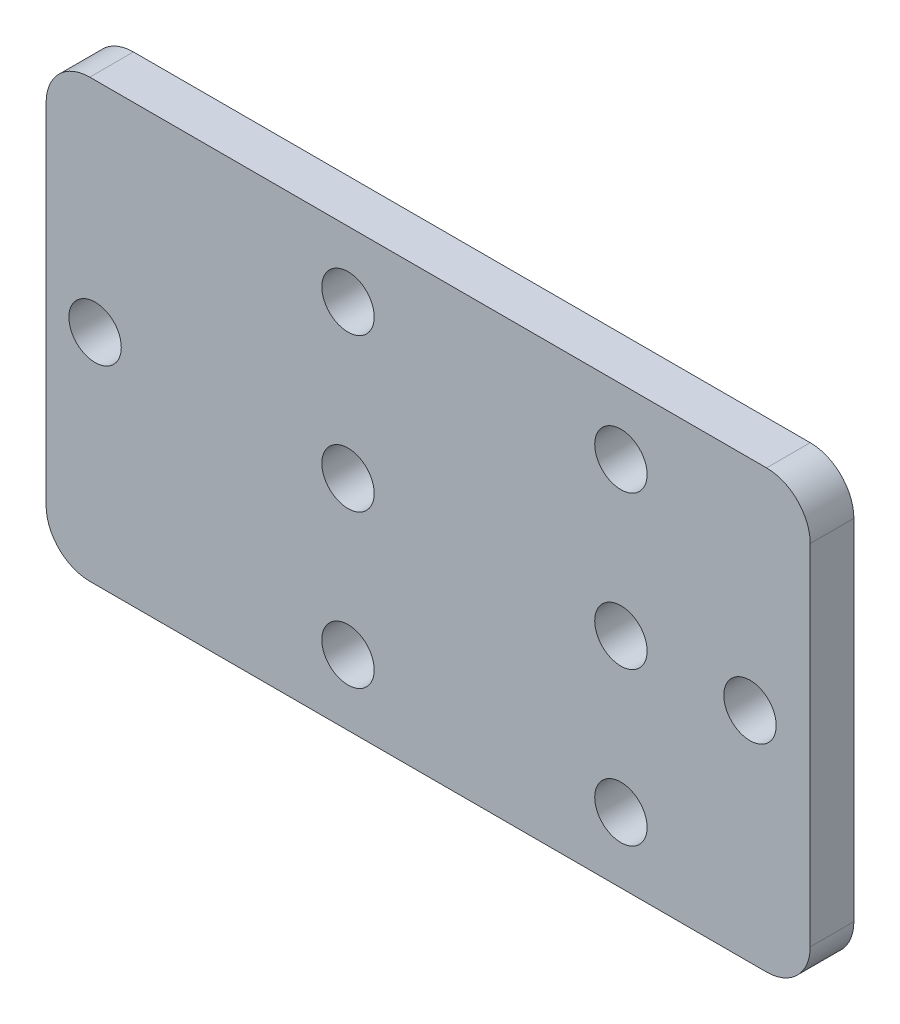
ISO-10303-21;
HEADER;
FILE_DESCRIPTION(('STEP AP214'),'2;1');
FILE_NAME('part.step','',(''),(''),'','','');
FILE_SCHEMA(('AUTOMOTIVE_DESIGN { 1 0 10303 214 1 1 1 1 }'));
ENDSEC;
DATA;
#1=APPLICATION_CONTEXT('core data for automotive mechanical design processes');
#2=APPLICATION_PROTOCOL_DEFINITION('international standard','automotive_design',2000,#1);
#3=PRODUCT_CONTEXT('',#1,'mechanical');
#4=PRODUCT('Part','Part','',(#3));
#5=PRODUCT_RELATED_PRODUCT_CATEGORY('part','',(#4));
#6=PRODUCT_DEFINITION_FORMATION('','',#4);
#7=PRODUCT_DEFINITION_CONTEXT('part definition',#1,'design');
#8=PRODUCT_DEFINITION('design','',#6,#7);
#9=PRODUCT_DEFINITION_SHAPE('','',#8);
#10=(LENGTH_UNIT() NAMED_UNIT(*) SI_UNIT(.MILLI.,.METRE.));
#11=(NAMED_UNIT(*) PLANE_ANGLE_UNIT() SI_UNIT($,.RADIAN.));
#12=(NAMED_UNIT(*) SI_UNIT($,.STERADIAN.) SOLID_ANGLE_UNIT());
#13=UNCERTAINTY_MEASURE_WITH_UNIT(LENGTH_MEASURE(1.E-05),#10,'distance_accuracy_value','');
#14=(GEOMETRIC_REPRESENTATION_CONTEXT(3) GLOBAL_UNCERTAINTY_ASSIGNED_CONTEXT((#13)) GLOBAL_UNIT_ASSIGNED_CONTEXT((#10,
#11,#12)) REPRESENTATION_CONTEXT('',''));
#15=CARTESIAN_POINT('',(0.,0.,0.));
#16=DIRECTION('',(0.,0.,1.));
#17=DIRECTION('',(1.,0.,0.));
#18=AXIS2_PLACEMENT_3D('',#15,#16,#17);
#19=CARTESIAN_POINT('',(0.,0.,2.54));
#20=DIRECTION('',(0.,0.,1.));
#21=DIRECTION('',(1.,0.,0.));
#22=AXIS2_PLACEMENT_3D('',#19,#20,#21);
#23=PLANE('',#22);
#24=CARTESIAN_POINT('',(28.3572576862532,-37.4796146435241,2.54));
#25=DIRECTION('',(0.,0.,1.));
#26=DIRECTION('',(-1.,0.,0.));
#27=AXIS2_PLACEMENT_3D('',#24,#25,#26);
#28=CIRCLE('',#27,1.524);
#29=CARTESIAN_POINT('',(26.8332576862532,-37.4796146435241,2.54));
#30=VERTEX_POINT('',#29);
#31=EDGE_CURVE('E217',#30,#30,#28,.T.);
#32=ORIENTED_EDGE('',*,*,#31,.F.);
#33=EDGE_LOOP('',(#32));
#34=FACE_BOUND('',#33,.T.);
#35=CARTESIAN_POINT('',(28.3572576862531,-19.6996146435241,2.54));
#36=DIRECTION('',(0.,0.,1.));
#37=DIRECTION('',(-1.,0.,0.));
#38=AXIS2_PLACEMENT_3D('',#35,#36,#37);
#39=CIRCLE('',#38,1.524);
#40=CARTESIAN_POINT('',(26.8332576862531,-19.6996146435241,2.54));
#41=VERTEX_POINT('',#40);
#42=EDGE_CURVE('E205',#41,#41,#39,.T.);
#43=ORIENTED_EDGE('',*,*,#42,.F.);
#44=EDGE_LOOP('',(#43));
#45=FACE_BOUND('',#44,.T.);
#46=CARTESIAN_POINT('',(28.3572576862531,-28.5896146435241,2.54));
#47=DIRECTION('',(0.,0.,1.));
#48=DIRECTION('',(-1.,0.,0.));
#49=AXIS2_PLACEMENT_3D('',#46,#47,#48);
#50=CIRCLE('',#49,1.524);
#51=CARTESIAN_POINT('',(26.8332576862531,-28.5896146435241,2.54));
#52=VERTEX_POINT('',#51);
#53=EDGE_CURVE('E193',#52,#52,#50,.T.);
#54=ORIENTED_EDGE('',*,*,#53,.F.);
#55=EDGE_LOOP('',(#54));
#56=FACE_BOUND('',#55,.T.);
#57=CARTESIAN_POINT('',(-2.2314915162104,-28.5896146435241,2.54));
#58=DIRECTION('',(0.,0.,1.));
#59=DIRECTION('',(1.,0.,0.));
#60=AXIS2_PLACEMENT_3D('',#57,#58,#59);
#61=CIRCLE('',#60,1.524);
#62=CARTESIAN_POINT('',(-0.707491516210404,-28.5896146435241,2.54));
#63=VERTEX_POINT('',#62);
#64=EDGE_CURVE('E176',#63,#63,#61,.T.);
#65=ORIENTED_EDGE('',*,*,#64,.F.);
#66=EDGE_LOOP('',(#65));
#67=FACE_BOUND('',#66,.T.);
#68=DIRECTION('',(1.,0.,0.));
#69=VECTOR('',#68,1.);
#70=CARTESIAN_POINT('',(-5.07999999999998,-41.2896146435241,2.54));
#71=LINE('',#70,#69);
#72=CARTESIAN_POINT('',(-2.53999999999998,-41.2896146435241,2.54));
#73=VERTEX_POINT('',#72);
#74=CARTESIAN_POINT('',(36.83,-41.2896146435241,2.54));
#75=VERTEX_POINT('',#74);
#76=EDGE_CURVE('E183',#73,#75,#71,.T.);
#77=ORIENTED_EDGE('',*,*,#76,.T.);
#78=CARTESIAN_POINT('',(36.83,-38.7496146435241,2.54));
#79=DIRECTION('',(0.,0.,1.));
#80=DIRECTION('',(1.,0.,0.));
#81=AXIS2_PLACEMENT_3D('',#78,#79,#80);
#82=CIRCLE('',#81,2.54);
#83=CARTESIAN_POINT('',(39.37,-38.7496146435241,2.54));
#84=VERTEX_POINT('',#83);
#85=EDGE_CURVE('E160',#75,#84,#82,.T.);
#86=ORIENTED_EDGE('',*,*,#85,.T.);
#87=DIRECTION('',(0.,1.,0.));
#88=VECTOR('',#87,1.);
#89=CARTESIAN_POINT('',(39.37,-15.8896146435241,2.54));
#90=LINE('',#89,#88);
#91=CARTESIAN_POINT('',(39.37,-18.4296146435241,2.54));
#92=VERTEX_POINT('',#91);
#93=EDGE_CURVE('E130',#84,#92,#90,.T.);
#94=ORIENTED_EDGE('',*,*,#93,.T.);
#95=CARTESIAN_POINT('',(36.83,-18.4296146435241,2.54));
#96=DIRECTION('',(0.,0.,1.));
#97=DIRECTION('',(1.,0.,0.));
#98=AXIS2_PLACEMENT_3D('',#95,#96,#97);
#99=CIRCLE('',#98,2.54);
#100=CARTESIAN_POINT('',(36.83,-15.8896146435241,2.54));
#101=VERTEX_POINT('',#100);
#102=EDGE_CURVE('E67',#92,#101,#99,.T.);
#103=ORIENTED_EDGE('',*,*,#102,.T.);
#104=DIRECTION('',(-1.,0.,0.));
#105=VECTOR('',#104,1.);
#106=CARTESIAN_POINT('',(-5.07999999999998,-15.8896146435241,2.54));
#107=LINE('',#106,#105);
#108=CARTESIAN_POINT('',(-2.53999999999998,-15.8896146435241,2.54));
#109=VERTEX_POINT('',#108);
#110=EDGE_CURVE('E146',#101,#109,#107,.T.);
#111=ORIENTED_EDGE('',*,*,#110,.T.);
#112=CARTESIAN_POINT('',(-2.53999999999998,-18.4296146435241,2.54));
#113=DIRECTION('',(0.,0.,1.));
#114=DIRECTION('',(1.,0.,0.));
#115=AXIS2_PLACEMENT_3D('',#112,#113,#114);
#116=CIRCLE('',#115,2.54);
#117=CARTESIAN_POINT('',(-5.07999999999998,-18.4296146435241,2.54));
#118=VERTEX_POINT('',#117);
#119=EDGE_CURVE('E155',#109,#118,#116,.T.);
#120=ORIENTED_EDGE('',*,*,#119,.T.);
#121=DIRECTION('',(0.,-1.,0.));
#122=VECTOR('',#121,1.);
#123=CARTESIAN_POINT('',(-5.07999999999998,-15.8896146435241,2.54));
#124=LINE('',#123,#122);
#125=CARTESIAN_POINT('',(-5.07999999999998,-38.7496146435241,2.54));
#126=VERTEX_POINT('',#125);
#127=EDGE_CURVE('E140',#118,#126,#124,.T.);
#128=ORIENTED_EDGE('',*,*,#127,.T.);
#129=CARTESIAN_POINT('',(-2.53999999999998,-38.7496146435241,2.54));
#130=DIRECTION('',(0.,0.,1.));
#131=DIRECTION('',(1.,0.,0.));
#132=AXIS2_PLACEMENT_3D('',#129,#130,#131);
#133=CIRCLE('',#132,2.54);
#134=EDGE_CURVE('E157',#126,#73,#133,.T.);
#135=ORIENTED_EDGE('',*,*,#134,.T.);
#136=EDGE_LOOP('',(#77,#86,#94,#103,#111,#120,#128,#135));
#137=FACE_BOUND('',#136,.T.);
#138=CARTESIAN_POINT('',(12.4822576862531,-28.5896146435241,2.54));
#139=DIRECTION('',(0.,0.,1.));
#140=DIRECTION('',(1.,0.,0.));
#141=AXIS2_PLACEMENT_3D('',#138,#139,#140);
#142=CIRCLE('',#141,1.524);
#143=CARTESIAN_POINT('',(14.0062576862531,-28.5896146435241,2.54));
#144=VERTEX_POINT('',#143);
#145=EDGE_CURVE('E188',#144,#144,#142,.T.);
#146=ORIENTED_EDGE('',*,*,#145,.F.);
#147=EDGE_LOOP('',(#146));
#148=FACE_BOUND('',#147,.T.);
#149=CARTESIAN_POINT('',(12.4822576862531,-19.6996146435241,2.54));
#150=DIRECTION('',(0.,0.,1.));
#151=DIRECTION('',(1.,0.,0.));
#152=AXIS2_PLACEMENT_3D('',#149,#150,#151);
#153=CIRCLE('',#152,1.524);
#154=CARTESIAN_POINT('',(14.0062576862531,-19.6996146435241,2.54));
#155=VERTEX_POINT('',#154);
#156=EDGE_CURVE('E199',#155,#155,#153,.T.);
#157=ORIENTED_EDGE('',*,*,#156,.F.);
#158=EDGE_LOOP('',(#157));
#159=FACE_BOUND('',#158,.T.);
#160=CARTESIAN_POINT('',(12.4822576862532,-37.4796146435241,2.54));
#161=DIRECTION('',(0.,0.,1.));
#162=DIRECTION('',(1.,0.,0.));
#163=AXIS2_PLACEMENT_3D('',#160,#161,#162);
#164=CIRCLE('',#163,1.524);
#165=CARTESIAN_POINT('',(14.0062576862532,-37.4796146435241,2.54));
#166=VERTEX_POINT('',#165);
#167=EDGE_CURVE('E211',#166,#166,#164,.T.);
#168=ORIENTED_EDGE('',*,*,#167,.F.);
#169=EDGE_LOOP('',(#168));
#170=FACE_BOUND('',#169,.T.);
#171=CARTESIAN_POINT('',(35.8685084837896,-28.5896146435241,2.54));
#172=DIRECTION('',(0.,0.,1.));
#173=DIRECTION('',(1.,0.,0.));
#174=AXIS2_PLACEMENT_3D('',#171,#172,#173);
#175=CIRCLE('',#174,1.524);
#176=CARTESIAN_POINT('',(37.3925084837896,-28.5896146435241,2.54));
#177=VERTEX_POINT('',#176);
#178=EDGE_CURVE('E223',#177,#177,#175,.T.);
#179=ORIENTED_EDGE('',*,*,#178,.F.);
#180=EDGE_LOOP('',(#179));
#181=FACE_BOUND('',#180,.T.);
#182=ADVANCED_FACE('F45',(#34,#45,#56,#67,#137,#148,#159,#170,#181),#23,.T.);
#183=CARTESIAN_POINT('',(0.,0.,0.));
#184=DIRECTION('',(0.,0.,1.));
#185=DIRECTION('',(1.,0.,0.));
#186=AXIS2_PLACEMENT_3D('',#183,#184,#185);
#187=PLANE('',#186);
#188=DIRECTION('',(0.,1.,0.));
#189=VECTOR('',#188,1.);
#190=CARTESIAN_POINT('',(39.37,-15.8896146435241,0.));
#191=LINE('',#190,#189);
#192=CARTESIAN_POINT('',(39.37,-38.7496146435241,0.));
#193=VERTEX_POINT('',#192);
#194=CARTESIAN_POINT('',(39.37,-18.4296146435241,0.));
#195=VERTEX_POINT('',#194);
#196=EDGE_CURVE('E128',#193,#195,#191,.T.);
#197=ORIENTED_EDGE('',*,*,#196,.F.);
#198=CARTESIAN_POINT('',(36.83,-38.7496146435241,0.));
#199=DIRECTION('',(0.,0.,1.));
#200=DIRECTION('',(1.,0.,0.));
#201=AXIS2_PLACEMENT_3D('',#198,#199,#200);
#202=CIRCLE('',#201,2.54);
#203=CARTESIAN_POINT('',(36.83,-41.2896146435241,0.));
#204=VERTEX_POINT('',#203);
#205=EDGE_CURVE('E111',#193,#204,#202,.F.);
#206=ORIENTED_EDGE('',*,*,#205,.T.);
#207=DIRECTION('',(1.,0.,0.));
#208=VECTOR('',#207,1.);
#209=CARTESIAN_POINT('',(-5.07999999999998,-41.2896146435241,0.));
#210=LINE('',#209,#208);
#211=CARTESIAN_POINT('',(-2.53999999999998,-41.2896146435241,0.));
#212=VERTEX_POINT('',#211);
#213=EDGE_CURVE('E138',#212,#204,#210,.T.);
#214=ORIENTED_EDGE('',*,*,#213,.F.);
#215=CARTESIAN_POINT('',(-2.53999999999998,-38.7496146435241,0.));
#216=DIRECTION('',(0.,0.,1.));
#217=DIRECTION('',(1.,0.,0.));
#218=AXIS2_PLACEMENT_3D('',#215,#216,#217);
#219=CIRCLE('',#218,2.54);
#220=CARTESIAN_POINT('',(-5.07999999999998,-38.7496146435241,0.));
#221=VERTEX_POINT('',#220);
#222=EDGE_CURVE('E149',#212,#221,#219,.F.);
#223=ORIENTED_EDGE('',*,*,#222,.T.);
#224=DIRECTION('',(0.,-1.,0.));
#225=VECTOR('',#224,1.);
#226=CARTESIAN_POINT('',(-5.07999999999998,-15.8896146435241,0.));
#227=LINE('',#226,#225);
#228=CARTESIAN_POINT('',(-5.07999999999998,-18.4296146435241,0.));
#229=VERTEX_POINT('',#228);
#230=EDGE_CURVE('E142',#229,#221,#227,.T.);
#231=ORIENTED_EDGE('',*,*,#230,.F.);
#232=CARTESIAN_POINT('',(-2.53999999999998,-18.4296146435241,0.));
#233=DIRECTION('',(0.,0.,1.));
#234=DIRECTION('',(1.,0.,0.));
#235=AXIS2_PLACEMENT_3D('',#232,#233,#234);
#236=CIRCLE('',#235,2.54);
#237=CARTESIAN_POINT('',(-2.53999999999998,-15.8896146435241,0.));
#238=VERTEX_POINT('',#237);
#239=EDGE_CURVE('E131',#229,#238,#236,.F.);
#240=ORIENTED_EDGE('',*,*,#239,.T.);
#241=DIRECTION('',(-1.,0.,0.));
#242=VECTOR('',#241,1.);
#243=CARTESIAN_POINT('',(-5.07999999999998,-15.8896146435241,0.));
#244=LINE('',#243,#242);
#245=CARTESIAN_POINT('',(36.83,-15.8896146435241,0.));
#246=VERTEX_POINT('',#245);
#247=EDGE_CURVE('E137',#246,#238,#244,.T.);
#248=ORIENTED_EDGE('',*,*,#247,.F.);
#249=CARTESIAN_POINT('',(36.83,-18.4296146435241,0.));
#250=DIRECTION('',(0.,0.,1.));
#251=DIRECTION('',(1.,0.,0.));
#252=AXIS2_PLACEMENT_3D('',#249,#250,#251);
#253=CIRCLE('',#252,2.54);
#254=EDGE_CURVE('E122',#246,#195,#253,.F.);
#255=ORIENTED_EDGE('',*,*,#254,.T.);
#256=EDGE_LOOP('',(#197,#206,#214,#223,#231,#240,#248,#255));
#257=FACE_BOUND('',#256,.T.);
#258=CARTESIAN_POINT('',(-2.2314915162104,-28.5896146435241,0.));
#259=DIRECTION('',(0.,0.,1.));
#260=DIRECTION('',(1.,0.,0.));
#261=AXIS2_PLACEMENT_3D('',#258,#259,#260);
#262=CIRCLE('',#261,1.524);
#263=CARTESIAN_POINT('',(-0.707491516210404,-28.5896146435241,0.));
#264=VERTEX_POINT('',#263);
#265=EDGE_CURVE('E178',#264,#264,#262,.T.);
#266=ORIENTED_EDGE('',*,*,#265,.T.);
#267=EDGE_LOOP('',(#266));
#268=FACE_BOUND('',#267,.T.);
#269=CARTESIAN_POINT('',(12.4822576862531,-28.5896146435241,0.));
#270=DIRECTION('',(0.,0.,1.));
#271=DIRECTION('',(1.,0.,0.));
#272=AXIS2_PLACEMENT_3D('',#269,#270,#271);
#273=CIRCLE('',#272,1.524);
#274=CARTESIAN_POINT('',(14.0062576862531,-28.5896146435241,0.));
#275=VERTEX_POINT('',#274);
#276=EDGE_CURVE('E190',#275,#275,#273,.T.);
#277=ORIENTED_EDGE('',*,*,#276,.T.);
#278=EDGE_LOOP('',(#277));
#279=FACE_BOUND('',#278,.T.);
#280=CARTESIAN_POINT('',(28.3572576862531,-28.5896146435241,0.));
#281=DIRECTION('',(0.,0.,1.));
#282=DIRECTION('',(-1.,0.,0.));
#283=AXIS2_PLACEMENT_3D('',#280,#281,#282);
#284=CIRCLE('',#283,1.524);
#285=CARTESIAN_POINT('',(26.8332576862531,-28.5896146435241,0.));
#286=VERTEX_POINT('',#285);
#287=EDGE_CURVE('E196',#286,#286,#284,.T.);
#288=ORIENTED_EDGE('',*,*,#287,.T.);
#289=EDGE_LOOP('',(#288));
#290=FACE_BOUND('',#289,.T.);
#291=CARTESIAN_POINT('',(12.4822576862531,-19.6996146435241,0.));
#292=DIRECTION('',(0.,0.,1.));
#293=DIRECTION('',(1.,0.,0.));
#294=AXIS2_PLACEMENT_3D('',#291,#292,#293);
#295=CIRCLE('',#294,1.524);
#296=CARTESIAN_POINT('',(14.0062576862531,-19.6996146435241,0.));
#297=VERTEX_POINT('',#296);
#298=EDGE_CURVE('E202',#297,#297,#295,.T.);
#299=ORIENTED_EDGE('',*,*,#298,.T.);
#300=EDGE_LOOP('',(#299));
#301=FACE_BOUND('',#300,.T.);
#302=CARTESIAN_POINT('',(28.3572576862531,-19.6996146435241,0.));
#303=DIRECTION('',(0.,0.,1.));
#304=DIRECTION('',(-1.,0.,0.));
#305=AXIS2_PLACEMENT_3D('',#302,#303,#304);
#306=CIRCLE('',#305,1.524);
#307=CARTESIAN_POINT('',(26.8332576862531,-19.6996146435241,0.));
#308=VERTEX_POINT('',#307);
#309=EDGE_CURVE('E208',#308,#308,#306,.T.);
#310=ORIENTED_EDGE('',*,*,#309,.T.);
#311=EDGE_LOOP('',(#310));
#312=FACE_BOUND('',#311,.T.);
#313=CARTESIAN_POINT('',(12.4822576862532,-37.4796146435241,0.));
#314=DIRECTION('',(0.,0.,1.));
#315=DIRECTION('',(1.,0.,0.));
#316=AXIS2_PLACEMENT_3D('',#313,#314,#315);
#317=CIRCLE('',#316,1.524);
#318=CARTESIAN_POINT('',(14.0062576862532,-37.4796146435241,0.));
#319=VERTEX_POINT('',#318);
#320=EDGE_CURVE('E214',#319,#319,#317,.T.);
#321=ORIENTED_EDGE('',*,*,#320,.T.);
#322=EDGE_LOOP('',(#321));
#323=FACE_BOUND('',#322,.T.);
#324=CARTESIAN_POINT('',(28.3572576862532,-37.4796146435241,0.));
#325=DIRECTION('',(0.,0.,1.));
#326=DIRECTION('',(-1.,0.,0.));
#327=AXIS2_PLACEMENT_3D('',#324,#325,#326);
#328=CIRCLE('',#327,1.524);
#329=CARTESIAN_POINT('',(26.8332576862532,-37.4796146435241,0.));
#330=VERTEX_POINT('',#329);
#331=EDGE_CURVE('E220',#330,#330,#328,.T.);
#332=ORIENTED_EDGE('',*,*,#331,.T.);
#333=EDGE_LOOP('',(#332));
#334=FACE_BOUND('',#333,.T.);
#335=CARTESIAN_POINT('',(35.8685084837896,-28.5896146435241,0.));
#336=DIRECTION('',(0.,0.,1.));
#337=DIRECTION('',(1.,0.,0.));
#338=AXIS2_PLACEMENT_3D('',#335,#336,#337);
#339=CIRCLE('',#338,1.524);
#340=CARTESIAN_POINT('',(37.3925084837896,-28.5896146435241,0.));
#341=VERTEX_POINT('',#340);
#342=EDGE_CURVE('E226',#341,#341,#339,.T.);
#343=ORIENTED_EDGE('',*,*,#342,.T.);
#344=EDGE_LOOP('',(#343));
#345=FACE_BOUND('',#344,.T.);
#346=ADVANCED_FACE('F134',(#257,#268,#279,#290,#301,#312,#323,#334,#345),#187,.F.);
#347=CARTESIAN_POINT('',(-5.07999999999998,-15.8896146435241,2.54));
#348=DIRECTION('',(1.,0.,0.));
#349=DIRECTION('',(0.,0.,-1.));
#350=AXIS2_PLACEMENT_3D('',#347,#348,#349);
#351=PLANE('',#350);
#352=ORIENTED_EDGE('',*,*,#230,.T.);
#353=DIRECTION('',(0.,0.,-1.));
#354=VECTOR('',#353,1.);
#355=CARTESIAN_POINT('',(-5.07999999999998,-38.7496146435241,2.54));
#356=LINE('',#355,#354);
#357=EDGE_CURVE('E11',#221,#126,#356,.F.);
#358=ORIENTED_EDGE('',*,*,#357,.T.);
#359=ORIENTED_EDGE('',*,*,#127,.F.);
#360=DIRECTION('',(0.,0.,-1.));
#361=VECTOR('',#360,1.);
#362=CARTESIAN_POINT('',(-5.07999999999998,-18.4296146435241,2.54));
#363=LINE('',#362,#361);
#364=EDGE_CURVE('E53',#118,#229,#363,.T.);
#365=ORIENTED_EDGE('',*,*,#364,.T.);
#366=EDGE_LOOP('',(#352,#358,#359,#365));
#367=FACE_BOUND('',#366,.T.);
#368=ADVANCED_FACE('F171',(#367),#351,.F.);
#369=CARTESIAN_POINT('',(-5.07999999999998,-41.2896146435241,2.54));
#370=DIRECTION('',(0.,1.,0.));
#371=DIRECTION('',(0.,0.,1.));
#372=AXIS2_PLACEMENT_3D('',#369,#370,#371);
#373=PLANE('',#372);
#374=ORIENTED_EDGE('',*,*,#213,.T.);
#375=DIRECTION('',(0.,0.,-1.));
#376=VECTOR('',#375,1.);
#377=CARTESIAN_POINT('',(36.83,-41.2896146435241,2.54));
#378=LINE('',#377,#376);
#379=EDGE_CURVE('E116',#204,#75,#378,.F.);
#380=ORIENTED_EDGE('',*,*,#379,.T.);
#381=ORIENTED_EDGE('',*,*,#76,.F.);
#382=DIRECTION('',(0.,0.,-1.));
#383=VECTOR('',#382,1.);
#384=CARTESIAN_POINT('',(-2.53999999999998,-41.2896146435241,2.54));
#385=LINE('',#384,#383);
#386=EDGE_CURVE('E121',#73,#212,#385,.T.);
#387=ORIENTED_EDGE('',*,*,#386,.T.);
#388=EDGE_LOOP('',(#374,#380,#381,#387));
#389=FACE_BOUND('',#388,.T.);
#390=ADVANCED_FACE('F254',(#389),#373,.F.);
#391=CARTESIAN_POINT('',(39.37,-15.8896146435241,2.54));
#392=DIRECTION('',(-1.,0.,0.));
#393=DIRECTION('',(0.,0.,1.));
#394=AXIS2_PLACEMENT_3D('',#391,#392,#393);
#395=PLANE('',#394);
#396=ORIENTED_EDGE('',*,*,#93,.F.);
#397=DIRECTION('',(0.,0.,-1.));
#398=VECTOR('',#397,1.);
#399=CARTESIAN_POINT('',(39.37,-38.7496146435241,2.54));
#400=LINE('',#399,#398);
#401=EDGE_CURVE('E115',#84,#193,#400,.T.);
#402=ORIENTED_EDGE('',*,*,#401,.T.);
#403=ORIENTED_EDGE('',*,*,#196,.T.);
#404=DIRECTION('',(0.,0.,-1.));
#405=VECTOR('',#404,1.);
#406=CARTESIAN_POINT('',(39.37,-18.4296146435241,2.54));
#407=LINE('',#406,#405);
#408=EDGE_CURVE('E132',#195,#92,#407,.F.);
#409=ORIENTED_EDGE('',*,*,#408,.T.);
#410=EDGE_LOOP('',(#396,#402,#403,#409));
#411=FACE_BOUND('',#410,.T.);
#412=ADVANCED_FACE('F127',(#411),#395,.F.);
#413=CARTESIAN_POINT('',(-5.07999999999998,-15.8896146435241,2.54));
#414=DIRECTION('',(0.,-1.,0.));
#415=DIRECTION('',(0.,0.,-1.));
#416=AXIS2_PLACEMENT_3D('',#413,#414,#415);
#417=PLANE('',#416);
#418=ORIENTED_EDGE('',*,*,#110,.F.);
#419=DIRECTION('',(0.,0.,-1.));
#420=VECTOR('',#419,1.);
#421=CARTESIAN_POINT('',(36.83,-15.8896146435241,2.54));
#422=LINE('',#421,#420);
#423=EDGE_CURVE('E163',#101,#246,#422,.T.);
#424=ORIENTED_EDGE('',*,*,#423,.T.);
#425=ORIENTED_EDGE('',*,*,#247,.T.);
#426=DIRECTION('',(0.,0.,-1.));
#427=VECTOR('',#426,1.);
#428=CARTESIAN_POINT('',(-2.53999999999998,-15.8896146435241,2.54));
#429=LINE('',#428,#427);
#430=EDGE_CURVE('E60',#238,#109,#429,.F.);
#431=ORIENTED_EDGE('',*,*,#430,.T.);
#432=EDGE_LOOP('',(#418,#424,#425,#431));
#433=FACE_BOUND('',#432,.T.);
#434=ADVANCED_FACE('F249',(#433),#417,.F.);
#435=CARTESIAN_POINT('',(-2.2314915162104,-28.5896146435241,2.54));
#436=DIRECTION('',(0.,0.,-1.));
#437=DIRECTION('',(-1.,0.,0.));
#438=AXIS2_PLACEMENT_3D('',#435,#436,#437);
#439=CYLINDRICAL_SURFACE('',#438,1.524);
#440=ORIENTED_EDGE('',*,*,#64,.T.);
#441=EDGE_LOOP('',(#440));
#442=FACE_BOUND('',#441,.T.);
#443=ORIENTED_EDGE('',*,*,#265,.F.);
#444=EDGE_LOOP('',(#443));
#445=FACE_BOUND('',#444,.T.);
#446=ADVANCED_FACE('F246',(#442,#445),#439,.F.);
#447=CARTESIAN_POINT('',(12.4822576862531,-28.5896146435241,2.54));
#448=DIRECTION('',(0.,0.,-1.));
#449=DIRECTION('',(-1.,0.,0.));
#450=AXIS2_PLACEMENT_3D('',#447,#448,#449);
#451=CYLINDRICAL_SURFACE('',#450,1.524);
#452=ORIENTED_EDGE('',*,*,#145,.T.);
#453=EDGE_LOOP('',(#452));
#454=FACE_BOUND('',#453,.T.);
#455=ORIENTED_EDGE('',*,*,#276,.F.);
#456=EDGE_LOOP('',(#455));
#457=FACE_BOUND('',#456,.T.);
#458=ADVANCED_FACE('F310',(#454,#457),#451,.F.);
#459=CARTESIAN_POINT('',(28.3572576862531,-28.5896146435241,2.54));
#460=DIRECTION('',(0.,0.,-1.));
#461=DIRECTION('',(-1.,0.,0.));
#462=AXIS2_PLACEMENT_3D('',#459,#460,#461);
#463=CYLINDRICAL_SURFACE('',#462,1.524);
#464=ORIENTED_EDGE('',*,*,#53,.T.);
#465=EDGE_LOOP('',(#464));
#466=FACE_BOUND('',#465,.T.);
#467=ORIENTED_EDGE('',*,*,#287,.F.);
#468=EDGE_LOOP('',(#467));
#469=FACE_BOUND('',#468,.T.);
#470=ADVANCED_FACE('F307',(#466,#469),#463,.F.);
#471=CARTESIAN_POINT('',(12.4822576862531,-19.6996146435241,2.54));
#472=DIRECTION('',(0.,0.,-1.));
#473=DIRECTION('',(-1.,0.,0.));
#474=AXIS2_PLACEMENT_3D('',#471,#472,#473);
#475=CYLINDRICAL_SURFACE('',#474,1.524);
#476=ORIENTED_EDGE('',*,*,#156,.T.);
#477=EDGE_LOOP('',(#476));
#478=FACE_BOUND('',#477,.T.);
#479=ORIENTED_EDGE('',*,*,#298,.F.);
#480=EDGE_LOOP('',(#479));
#481=FACE_BOUND('',#480,.T.);
#482=ADVANCED_FACE('F303',(#478,#481),#475,.F.);
#483=CARTESIAN_POINT('',(28.3572576862531,-19.6996146435241,2.54));
#484=DIRECTION('',(0.,0.,-1.));
#485=DIRECTION('',(-1.,0.,0.));
#486=AXIS2_PLACEMENT_3D('',#483,#484,#485);
#487=CYLINDRICAL_SURFACE('',#486,1.524);
#488=ORIENTED_EDGE('',*,*,#42,.T.);
#489=EDGE_LOOP('',(#488));
#490=FACE_BOUND('',#489,.T.);
#491=ORIENTED_EDGE('',*,*,#309,.F.);
#492=EDGE_LOOP('',(#491));
#493=FACE_BOUND('',#492,.T.);
#494=ADVANCED_FACE('F286',(#490,#493),#487,.F.);
#495=CARTESIAN_POINT('',(12.4822576862532,-37.4796146435241,2.54));
#496=DIRECTION('',(0.,0.,-1.));
#497=DIRECTION('',(-1.,0.,0.));
#498=AXIS2_PLACEMENT_3D('',#495,#496,#497);
#499=CYLINDRICAL_SURFACE('',#498,1.524);
#500=ORIENTED_EDGE('',*,*,#167,.T.);
#501=EDGE_LOOP('',(#500));
#502=FACE_BOUND('',#501,.T.);
#503=ORIENTED_EDGE('',*,*,#320,.F.);
#504=EDGE_LOOP('',(#503));
#505=FACE_BOUND('',#504,.T.);
#506=ADVANCED_FACE('F282',(#502,#505),#499,.F.);
#507=CARTESIAN_POINT('',(28.3572576862532,-37.4796146435241,2.54));
#508=DIRECTION('',(0.,0.,-1.));
#509=DIRECTION('',(-1.,0.,0.));
#510=AXIS2_PLACEMENT_3D('',#507,#508,#509);
#511=CYLINDRICAL_SURFACE('',#510,1.524);
#512=ORIENTED_EDGE('',*,*,#31,.T.);
#513=EDGE_LOOP('',(#512));
#514=FACE_BOUND('',#513,.T.);
#515=ORIENTED_EDGE('',*,*,#331,.F.);
#516=EDGE_LOOP('',(#515));
#517=FACE_BOUND('',#516,.T.);
#518=ADVANCED_FACE('F285',(#514,#517),#511,.F.);
#519=CARTESIAN_POINT('',(35.8685084837896,-28.5896146435241,2.54));
#520=DIRECTION('',(0.,0.,-1.));
#521=DIRECTION('',(-1.,0.,0.));
#522=AXIS2_PLACEMENT_3D('',#519,#520,#521);
#523=CYLINDRICAL_SURFACE('',#522,1.524);
#524=ORIENTED_EDGE('',*,*,#178,.T.);
#525=EDGE_LOOP('',(#524));
#526=FACE_BOUND('',#525,.T.);
#527=ORIENTED_EDGE('',*,*,#342,.F.);
#528=EDGE_LOOP('',(#527));
#529=FACE_BOUND('',#528,.T.);
#530=ADVANCED_FACE('F232',(#526,#529),#523,.F.);
#531=CARTESIAN_POINT('',(36.83,-38.7496146435241,2.54));
#532=DIRECTION('',(0.,0.,-1.));
#533=DIRECTION('',(-1.,0.,0.));
#534=AXIS2_PLACEMENT_3D('',#531,#532,#533);
#535=CYLINDRICAL_SURFACE('',#534,2.54);
#536=ORIENTED_EDGE('',*,*,#85,.F.);
#537=ORIENTED_EDGE('',*,*,#379,.F.);
#538=ORIENTED_EDGE('',*,*,#205,.F.);
#539=ORIENTED_EDGE('',*,*,#401,.F.);
#540=EDGE_LOOP('',(#536,#537,#538,#539));
#541=FACE_BOUND('',#540,.T.);
#542=ADVANCED_FACE('F114',(#541),#535,.T.);
#543=CARTESIAN_POINT('',(36.83,-18.4296146435241,2.54));
#544=DIRECTION('',(0.,0.,-1.));
#545=DIRECTION('',(-1.,0.,0.));
#546=AXIS2_PLACEMENT_3D('',#543,#544,#545);
#547=CYLINDRICAL_SURFACE('',#546,2.54);
#548=ORIENTED_EDGE('',*,*,#102,.F.);
#549=ORIENTED_EDGE('',*,*,#408,.F.);
#550=ORIENTED_EDGE('',*,*,#254,.F.);
#551=ORIENTED_EDGE('',*,*,#423,.F.);
#552=EDGE_LOOP('',(#548,#549,#550,#551));
#553=FACE_BOUND('',#552,.T.);
#554=ADVANCED_FACE('F262',(#553),#547,.T.);
#555=CARTESIAN_POINT('',(-2.53999999999998,-38.7496146435241,2.54));
#556=DIRECTION('',(0.,0.,-1.));
#557=DIRECTION('',(-1.,0.,0.));
#558=AXIS2_PLACEMENT_3D('',#555,#556,#557);
#559=CYLINDRICAL_SURFACE('',#558,2.54);
#560=ORIENTED_EDGE('',*,*,#134,.F.);
#561=ORIENTED_EDGE('',*,*,#357,.F.);
#562=ORIENTED_EDGE('',*,*,#222,.F.);
#563=ORIENTED_EDGE('',*,*,#386,.F.);
#564=EDGE_LOOP('',(#560,#561,#562,#563));
#565=FACE_BOUND('',#564,.T.);
#566=ADVANCED_FACE('F264',(#565),#559,.T.);
#567=CARTESIAN_POINT('',(-2.53999999999998,-18.4296146435241,2.54));
#568=DIRECTION('',(0.,0.,-1.));
#569=DIRECTION('',(-1.,0.,0.));
#570=AXIS2_PLACEMENT_3D('',#567,#568,#569);
#571=CYLINDRICAL_SURFACE('',#570,2.54);
#572=ORIENTED_EDGE('',*,*,#119,.F.);
#573=ORIENTED_EDGE('',*,*,#430,.F.);
#574=ORIENTED_EDGE('',*,*,#239,.F.);
#575=ORIENTED_EDGE('',*,*,#364,.F.);
#576=EDGE_LOOP('',(#572,#573,#574,#575));
#577=FACE_BOUND('',#576,.T.);
#578=ADVANCED_FACE('F47',(#577),#571,.T.);
#579=CLOSED_SHELL('',(#182,#346,#368,#390,#412,#434,#446,#458,#470,#482,#494,#506,#518,#530,
#542,#554,#566,#578));
#580=MANIFOLD_SOLID_BREP('B2',#579);
#581=ADVANCED_BREP_SHAPE_REPRESENTATION('',(#18,#580),#14);
#582=SHAPE_DEFINITION_REPRESENTATION(#9,#581);
ENDSEC;
END-ISO-10303-21;
